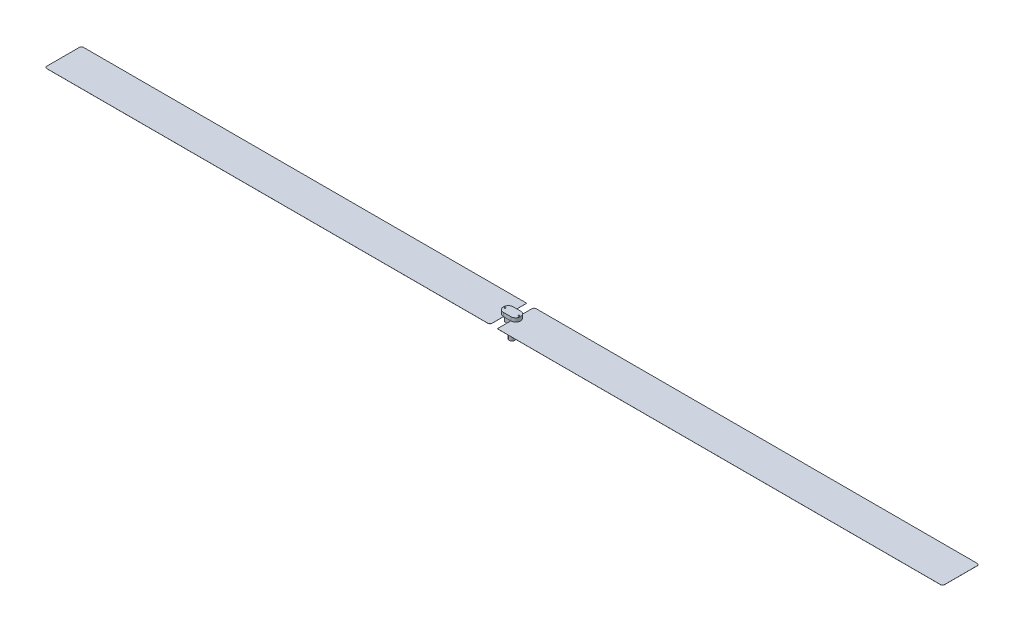
ISO-10303-21;
HEADER;
FILE_DESCRIPTION(('STEP AP214'),'2;1');
FILE_NAME('part.step','',(''),(''),'','','');
FILE_SCHEMA(('AUTOMOTIVE_DESIGN { 1 0 10303 214 1 1 1 1 }'));
ENDSEC;
DATA;
#1=APPLICATION_CONTEXT('core data for automotive mechanical design processes');
#2=APPLICATION_PROTOCOL_DEFINITION('international standard','automotive_design',2000,#1);
#3=PRODUCT_CONTEXT('',#1,'mechanical');
#4=PRODUCT('Part','Part','',(#3));
#5=PRODUCT_RELATED_PRODUCT_CATEGORY('part','',(#4));
#6=PRODUCT_DEFINITION_FORMATION('','',#4);
#7=PRODUCT_DEFINITION_CONTEXT('part definition',#1,'design');
#8=PRODUCT_DEFINITION('design','',#6,#7);
#9=PRODUCT_DEFINITION_SHAPE('','',#8);
#10=(LENGTH_UNIT() NAMED_UNIT(*) SI_UNIT(.MILLI.,.METRE.));
#11=(NAMED_UNIT(*) PLANE_ANGLE_UNIT() SI_UNIT($,.RADIAN.));
#12=(NAMED_UNIT(*) SI_UNIT($,.STERADIAN.) SOLID_ANGLE_UNIT());
#13=UNCERTAINTY_MEASURE_WITH_UNIT(LENGTH_MEASURE(1.E-05),#10,'distance_accuracy_value','');
#14=(GEOMETRIC_REPRESENTATION_CONTEXT(3) GLOBAL_UNCERTAINTY_ASSIGNED_CONTEXT((#13)) GLOBAL_UNIT_ASSIGNED_CONTEXT((#10,
#11,#12)) REPRESENTATION_CONTEXT('',''));
#15=CARTESIAN_POINT('',(0.,0.,0.));
#16=DIRECTION('',(0.,0.,1.));
#17=DIRECTION('',(1.,0.,0.));
#18=AXIS2_PLACEMENT_3D('',#15,#16,#17);
#19=CARTESIAN_POINT('',(-0.5,2.7,0.));
#20=DIRECTION('',(0.,1.,0.));
#21=DIRECTION('',(0.,0.,1.));
#22=AXIS2_PLACEMENT_3D('',#19,#20,#21);
#23=PLANE('',#22);
#24=DIRECTION('',(0.,0.,1.));
#25=VECTOR('',#24,1.);
#26=CARTESIAN_POINT('',(-0.5,2.7,-2.2));
#27=LINE('',#26,#25);
#28=CARTESIAN_POINT('',(-0.5,2.7,-0.662390111813238));
#29=VERTEX_POINT('',#28);
#30=CARTESIAN_POINT('',(-0.5,2.7,-0.5));
#31=VERTEX_POINT('',#30);
#32=EDGE_CURVE('E775',#29,#31,#27,.T.);
#33=ORIENTED_EDGE('',*,*,#32,.F.);
#34=DIRECTION('',(-1.,0.,0.));
#35=VECTOR('',#34,1.);
#36=CARTESIAN_POINT('',(-0.5,2.7,-0.662390111813238));
#37=LINE('',#36,#35);
#38=CARTESIAN_POINT('',(0.5,2.7,-0.662390111813238));
#39=VERTEX_POINT('',#38);
#40=EDGE_CURVE('E304',#39,#29,#37,.T.);
#41=ORIENTED_EDGE('',*,*,#40,.F.);
#42=DIRECTION('',(0.,0.,-1.));
#43=VECTOR('',#42,1.);
#44=CARTESIAN_POINT('',(0.5,2.7,-2.2));
#45=LINE('',#44,#43);
#46=CARTESIAN_POINT('',(0.5,2.7,-0.5));
#47=VERTEX_POINT('',#46);
#48=EDGE_CURVE('E801',#47,#39,#45,.T.);
#49=ORIENTED_EDGE('',*,*,#48,.F.);
#50=DIRECTION('',(-1.,0.,0.));
#51=VECTOR('',#50,1.);
#52=CARTESIAN_POINT('',(-0.5,2.7,-0.5));
#53=LINE('',#52,#51);
#54=EDGE_CURVE('E333',#47,#31,#53,.T.);
#55=ORIENTED_EDGE('',*,*,#54,.T.);
#56=EDGE_LOOP('',(#33,#41,#49,#55));
#57=FACE_BOUND('',#56,.T.);
#58=ADVANCED_FACE('F36',(#57),#23,.F.);
#59=CARTESIAN_POINT('',(-0.5,2.7,0.5));
#60=VERTEX_POINT('',#59);
#61=CARTESIAN_POINT('',(-0.5,2.7,0.662390111813238));
#62=VERTEX_POINT('',#61);
#63=EDGE_CURVE('E785',#60,#62,#27,.T.);
#64=ORIENTED_EDGE('',*,*,#63,.F.);
#65=DIRECTION('',(1.,0.,0.));
#66=VECTOR('',#65,1.);
#67=CARTESIAN_POINT('',(-0.5,2.7,0.5));
#68=LINE('',#67,#66);
#69=CARTESIAN_POINT('',(0.5,2.7,0.499999999999999));
#70=VERTEX_POINT('',#69);
#71=EDGE_CURVE('E336',#60,#70,#68,.T.);
#72=ORIENTED_EDGE('',*,*,#71,.T.);
#73=CARTESIAN_POINT('',(0.5,2.7,0.662390111813238));
#74=VERTEX_POINT('',#73);
#75=EDGE_CURVE('E258',#74,#70,#45,.T.);
#76=ORIENTED_EDGE('',*,*,#75,.F.);
#77=DIRECTION('',(1.,0.,0.));
#78=VECTOR('',#77,1.);
#79=CARTESIAN_POINT('',(-0.5,2.7,0.662390111813238));
#80=LINE('',#79,#78);
#81=EDGE_CURVE('E313',#62,#74,#80,.T.);
#82=ORIENTED_EDGE('',*,*,#81,.F.);
#83=EDGE_LOOP('',(#64,#72,#76,#82));
#84=FACE_BOUND('',#83,.T.);
#85=ADVANCED_FACE('F378',(#84),#23,.F.);
#86=CARTESIAN_POINT('',(-0.5,2.7,0.5));
#87=DIRECTION('',(1.,0.,0.));
#88=DIRECTION('',(0.,0.,-1.));
#89=AXIS2_PLACEMENT_3D('',#86,#87,#88);
#90=PLANE('',#89);
#91=DIRECTION('',(0.,0.,1.));
#92=VECTOR('',#91,1.);
#93=CARTESIAN_POINT('',(-0.5,2.69,-2.5));
#94=LINE('',#93,#92);
#95=CARTESIAN_POINT('',(-0.5,2.69,-0.5));
#96=VERTEX_POINT('',#95);
#97=CARTESIAN_POINT('',(-0.5,2.69,0.5));
#98=VERTEX_POINT('',#97);
#99=EDGE_CURVE('E821',#96,#98,#94,.T.);
#100=ORIENTED_EDGE('',*,*,#99,.F.);
#101=DIRECTION('',(0.,-1.,0.));
#102=VECTOR('',#101,1.);
#103=CARTESIAN_POINT('',(-0.5,2.7,-0.5));
#104=LINE('',#103,#102);
#105=CARTESIAN_POINT('',(-0.5,2.,-0.5));
#106=VERTEX_POINT('',#105);
#107=EDGE_CURVE('E351',#96,#106,#104,.T.);
#108=ORIENTED_EDGE('',*,*,#107,.T.);
#109=DIRECTION('',(0.,0.,1.));
#110=VECTOR('',#109,1.);
#111=CARTESIAN_POINT('',(-0.5,2.,0.5));
#112=LINE('',#111,#110);
#113=CARTESIAN_POINT('',(-0.5,2.,0.5));
#114=VERTEX_POINT('',#113);
#115=EDGE_CURVE('E344',#106,#114,#112,.T.);
#116=ORIENTED_EDGE('',*,*,#115,.T.);
#117=DIRECTION('',(0.,-1.,0.));
#118=VECTOR('',#117,1.);
#119=CARTESIAN_POINT('',(-0.5,2.7,0.5));
#120=LINE('',#119,#118);
#121=EDGE_CURVE('E58',#98,#114,#120,.T.);
#122=ORIENTED_EDGE('',*,*,#121,.F.);
#123=EDGE_LOOP('',(#100,#108,#116,#122));
#124=FACE_BOUND('',#123,.T.);
#125=ADVANCED_FACE('F371',(#124),#90,.F.);
#126=CARTESIAN_POINT('',(0.,0.,0.));
#127=DIRECTION('',(0.,1.,0.));
#128=DIRECTION('',(0.,0.,1.));
#129=AXIS2_PLACEMENT_3D('',#126,#127,#128);
#130=PLANE('',#129);
#131=CARTESIAN_POINT('',(0.,0.,0.));
#132=DIRECTION('',(0.,1.,0.));
#133=DIRECTION('',(0.,0.,1.));
#134=AXIS2_PLACEMENT_3D('',#131,#132,#133);
#135=CIRCLE('',#134,0.377024050356376);
#136=CARTESIAN_POINT('',(0.,0.,0.377024050356376));
#137=VERTEX_POINT('',#136);
#138=EDGE_CURVE('E40',#137,#137,#135,.T.);
#139=ORIENTED_EDGE('',*,*,#138,.F.);
#140=EDGE_LOOP('',(#139));
#141=FACE_BOUND('',#140,.T.);
#142=CARTESIAN_POINT('',(0.,0.,0.));
#143=DIRECTION('',(0.,1.,0.));
#144=DIRECTION('',(0.,0.,1.));
#145=AXIS2_PLACEMENT_3D('',#142,#143,#144);
#146=CIRCLE('',#145,0.3);
#147=CARTESIAN_POINT('',(0.,0.,0.3));
#148=VERTEX_POINT('',#147);
#149=EDGE_CURVE('E361',#148,#148,#146,.T.);
#150=ORIENTED_EDGE('',*,*,#149,.T.);
#151=EDGE_LOOP('',(#150));
#152=FACE_BOUND('',#151,.T.);
#153=ADVANCED_FACE('F369',(#141,#152),#130,.F.);
#154=CARTESIAN_POINT('',(0.,2.,0.));
#155=DIRECTION('',(0.,-1.,0.));
#156=DIRECTION('',(0.,0.,-1.));
#157=AXIS2_PLACEMENT_3D('',#154,#155,#156);
#158=CYLINDRICAL_SURFACE('',#157,0.377024050356376);
#159=CARTESIAN_POINT('',(0.,2.,0.));
#160=DIRECTION('',(0.,1.,0.));
#161=DIRECTION('',(0.,0.,1.));
#162=AXIS2_PLACEMENT_3D('',#159,#160,#161);
#163=CIRCLE('',#162,0.377024050356376);
#164=CARTESIAN_POINT('',(0.,2.,0.377024050356376));
#165=VERTEX_POINT('',#164);
#166=EDGE_CURVE('E11',#165,#165,#163,.T.);
#167=ORIENTED_EDGE('',*,*,#166,.F.);
#168=EDGE_LOOP('',(#167));
#169=FACE_BOUND('',#168,.T.);
#170=ORIENTED_EDGE('',*,*,#138,.T.);
#171=EDGE_LOOP('',(#170));
#172=FACE_BOUND('',#171,.T.);
#173=ADVANCED_FACE('F38',(#169,#172),#158,.T.);
#174=CARTESIAN_POINT('',(0.,2.,0.));
#175=DIRECTION('',(0.,-1.,0.));
#176=DIRECTION('',(0.,0.,-1.));
#177=AXIS2_PLACEMENT_3D('',#174,#175,#176);
#178=CYLINDRICAL_SURFACE('',#177,0.3);
#179=CARTESIAN_POINT('',(0.,2.,0.));
#180=DIRECTION('',(0.,1.,0.));
#181=DIRECTION('',(0.,0.,1.));
#182=AXIS2_PLACEMENT_3D('',#179,#180,#181);
#183=CIRCLE('',#182,0.3);
#184=CARTESIAN_POINT('',(0.,2.,0.3));
#185=VERTEX_POINT('',#184);
#186=EDGE_CURVE('E358',#185,#185,#183,.T.);
#187=ORIENTED_EDGE('',*,*,#186,.T.);
#188=EDGE_LOOP('',(#187));
#189=FACE_BOUND('',#188,.T.);
#190=ORIENTED_EDGE('',*,*,#149,.F.);
#191=EDGE_LOOP('',(#190));
#192=FACE_BOUND('',#191,.T.);
#193=ADVANCED_FACE('F376',(#189,#192),#178,.F.);
#194=CARTESIAN_POINT('',(0.,2.,0.));
#195=DIRECTION('',(0.,-1.,0.));
#196=DIRECTION('',(0.,0.,-1.));
#197=AXIS2_PLACEMENT_3D('',#194,#195,#196);
#198=PLANE('',#197);
#199=ORIENTED_EDGE('',*,*,#186,.F.);
#200=EDGE_LOOP('',(#199));
#201=FACE_BOUND('',#200,.T.);
#202=ADVANCED_FACE('F415',(#201),#198,.T.);
#203=CARTESIAN_POINT('',(0.5,2.7,0.5));
#204=DIRECTION('',(-1.,0.,0.));
#205=DIRECTION('',(0.,0.,1.));
#206=AXIS2_PLACEMENT_3D('',#203,#204,#205);
#207=PLANE('',#206);
#208=DIRECTION('',(0.,-1.,0.));
#209=VECTOR('',#208,1.);
#210=CARTESIAN_POINT('',(0.5,2.7,-0.5));
#211=LINE('',#210,#209);
#212=CARTESIAN_POINT('',(0.5,2.69,-0.5));
#213=VERTEX_POINT('',#212);
#214=CARTESIAN_POINT('',(0.5,2.,-0.5));
#215=VERTEX_POINT('',#214);
#216=EDGE_CURVE('E354',#213,#215,#211,.T.);
#217=ORIENTED_EDGE('',*,*,#216,.F.);
#218=DIRECTION('',(0.,0.,-1.));
#219=VECTOR('',#218,1.);
#220=CARTESIAN_POINT('',(0.5,2.69,-2.2));
#221=LINE('',#220,#219);
#222=CARTESIAN_POINT('',(0.5,2.69,0.499999999999999));
#223=VERTEX_POINT('',#222);
#224=EDGE_CURVE('E243',#223,#213,#221,.T.);
#225=ORIENTED_EDGE('',*,*,#224,.F.);
#226=DIRECTION('',(0.,-1.,0.));
#227=VECTOR('',#226,1.);
#228=CARTESIAN_POINT('',(0.5,2.7,0.5));
#229=LINE('',#228,#227);
#230=CARTESIAN_POINT('',(0.5,2.,0.5));
#231=VERTEX_POINT('',#230);
#232=EDGE_CURVE('E51',#223,#231,#229,.T.);
#233=ORIENTED_EDGE('',*,*,#232,.T.);
#234=DIRECTION('',(0.,0.,-1.));
#235=VECTOR('',#234,1.);
#236=CARTESIAN_POINT('',(0.5,2.,0.5));
#237=LINE('',#236,#235);
#238=EDGE_CURVE('E332',#231,#215,#237,.T.);
#239=ORIENTED_EDGE('',*,*,#238,.T.);
#240=EDGE_LOOP('',(#217,#225,#233,#239));
#241=FACE_BOUND('',#240,.T.);
#242=ADVANCED_FACE('F421',(#241),#207,.F.);
#243=CARTESIAN_POINT('',(-0.5,2.7,-0.5));
#244=DIRECTION('',(0.,0.,1.));
#245=DIRECTION('',(1.,0.,0.));
#246=AXIS2_PLACEMENT_3D('',#243,#244,#245);
#247=PLANE('',#246);
#248=DIRECTION('',(-1.,0.,0.));
#249=VECTOR('',#248,1.);
#250=CARTESIAN_POINT('',(-0.5,2.,-0.5));
#251=LINE('',#250,#249);
#252=EDGE_CURVE('E341',#215,#106,#251,.T.);
#253=ORIENTED_EDGE('',*,*,#252,.T.);
#254=ORIENTED_EDGE('',*,*,#107,.F.);
#255=EDGE_CURVE('E352',#31,#96,#104,.T.);
#256=ORIENTED_EDGE('',*,*,#255,.F.);
#257=ORIENTED_EDGE('',*,*,#54,.F.);
#258=EDGE_CURVE('E355',#47,#213,#211,.T.);
#259=ORIENTED_EDGE('',*,*,#258,.T.);
#260=ORIENTED_EDGE('',*,*,#216,.T.);
#261=EDGE_LOOP('',(#253,#254,#256,#257,#259,#260));
#262=FACE_BOUND('',#261,.T.);
#263=ADVANCED_FACE('F417',(#262),#247,.F.);
#264=CARTESIAN_POINT('',(-0.5,2.7,0.5));
#265=DIRECTION('',(0.,0.,-1.));
#266=DIRECTION('',(-1.,0.,0.));
#267=AXIS2_PLACEMENT_3D('',#264,#265,#266);
#268=PLANE('',#267);
#269=DIRECTION('',(1.,0.,0.));
#270=VECTOR('',#269,1.);
#271=CARTESIAN_POINT('',(-0.5,2.,0.5));
#272=LINE('',#271,#270);
#273=EDGE_CURVE('E337',#114,#231,#272,.T.);
#274=ORIENTED_EDGE('',*,*,#273,.T.);
#275=ORIENTED_EDGE('',*,*,#232,.F.);
#276=EDGE_CURVE('E347',#70,#223,#229,.T.);
#277=ORIENTED_EDGE('',*,*,#276,.F.);
#278=ORIENTED_EDGE('',*,*,#71,.F.);
#279=EDGE_CURVE('E349',#60,#98,#120,.T.);
#280=ORIENTED_EDGE('',*,*,#279,.T.);
#281=ORIENTED_EDGE('',*,*,#121,.T.);
#282=EDGE_LOOP('',(#274,#275,#277,#278,#280,#281));
#283=FACE_BOUND('',#282,.T.);
#284=ADVANCED_FACE('F413',(#283),#268,.F.);
#285=ORIENTED_EDGE('',*,*,#166,.T.);
#286=EDGE_LOOP('',(#285));
#287=FACE_BOUND('',#286,.T.);
#288=ORIENTED_EDGE('',*,*,#238,.F.);
#289=ORIENTED_EDGE('',*,*,#273,.F.);
#290=ORIENTED_EDGE('',*,*,#115,.F.);
#291=ORIENTED_EDGE('',*,*,#252,.F.);
#292=EDGE_LOOP('',(#288,#289,#290,#291));
#293=FACE_BOUND('',#292,.T.);
#294=ADVANCED_FACE('F409',(#287,#293),#198,.T.);
#295=CARTESIAN_POINT('',(-0.5,3.2,0.));
#296=DIRECTION('',(0.,-1.,0.));
#297=DIRECTION('',(0.,0.,-1.));
#298=AXIS2_PLACEMENT_3D('',#295,#296,#297);
#299=CYLINDRICAL_SURFACE('',#298,0.662390111813238);
#300=CARTESIAN_POINT('',(-0.5,2.7,0.));
#301=DIRECTION('',(0.,1.,0.));
#302=DIRECTION('',(0.,0.,1.));
#303=AXIS2_PLACEMENT_3D('',#300,#301,#302);
#304=CIRCLE('',#303,0.662390111813238);
#305=EDGE_CURVE('E291',#29,#62,#304,.T.);
#306=ORIENTED_EDGE('',*,*,#305,.T.);
#307=DIRECTION('',(0.,-1.,0.));
#308=VECTOR('',#307,1.);
#309=CARTESIAN_POINT('',(-0.5,3.2,0.662390111813238));
#310=LINE('',#309,#308);
#311=CARTESIAN_POINT('',(-0.5,3.2,0.662390111813238));
#312=VERTEX_POINT('',#311);
#313=EDGE_CURVE('E329',#312,#62,#310,.T.);
#314=ORIENTED_EDGE('',*,*,#313,.F.);
#315=CARTESIAN_POINT('',(-0.5,3.2,0.));
#316=DIRECTION('',(0.,1.,0.));
#317=DIRECTION('',(0.,0.,1.));
#318=AXIS2_PLACEMENT_3D('',#315,#316,#317);
#319=CIRCLE('',#318,0.662390111813238);
#320=CARTESIAN_POINT('',(-0.5,3.2,-0.662390111813238));
#321=VERTEX_POINT('',#320);
#322=EDGE_CURVE('E300',#321,#312,#319,.T.);
#323=ORIENTED_EDGE('',*,*,#322,.F.);
#324=DIRECTION('',(0.,-1.,0.));
#325=VECTOR('',#324,1.);
#326=CARTESIAN_POINT('',(-0.5,3.2,-0.662390111813238));
#327=LINE('',#326,#325);
#328=EDGE_CURVE('E310',#321,#29,#327,.T.);
#329=ORIENTED_EDGE('',*,*,#328,.T.);
#330=EDGE_LOOP('',(#306,#314,#323,#329));
#331=FACE_BOUND('',#330,.T.);
#332=ADVANCED_FACE('F405',(#331),#299,.T.);
#333=CARTESIAN_POINT('',(-0.5,3.2,0.662390111813238));
#334=DIRECTION('',(0.,0.,-1.));
#335=DIRECTION('',(-1.,0.,0.));
#336=AXIS2_PLACEMENT_3D('',#333,#334,#335);
#337=PLANE('',#336);
#338=ORIENTED_EDGE('',*,*,#81,.T.);
#339=DIRECTION('',(0.,-1.,0.));
#340=VECTOR('',#339,1.);
#341=CARTESIAN_POINT('',(0.5,3.2,0.662390111813238));
#342=LINE('',#341,#340);
#343=CARTESIAN_POINT('',(0.5,3.2,0.662390111813238));
#344=VERTEX_POINT('',#343);
#345=EDGE_CURVE('E326',#344,#74,#342,.T.);
#346=ORIENTED_EDGE('',*,*,#345,.F.);
#347=DIRECTION('',(1.,0.,0.));
#348=VECTOR('',#347,1.);
#349=CARTESIAN_POINT('',(-0.5,3.2,0.662390111813238));
#350=LINE('',#349,#348);
#351=EDGE_CURVE('E303',#312,#344,#350,.T.);
#352=ORIENTED_EDGE('',*,*,#351,.F.);
#353=ORIENTED_EDGE('',*,*,#313,.T.);
#354=EDGE_LOOP('',(#338,#346,#352,#353));
#355=FACE_BOUND('',#354,.T.);
#356=ADVANCED_FACE('F401',(#355),#337,.F.);
#357=CARTESIAN_POINT('',(0.5,3.2,0.));
#358=DIRECTION('',(0.,-1.,0.));
#359=DIRECTION('',(0.,0.,-1.));
#360=AXIS2_PLACEMENT_3D('',#357,#358,#359);
#361=CYLINDRICAL_SURFACE('',#360,0.662390111813238);
#362=CARTESIAN_POINT('',(0.5,2.7,0.));
#363=DIRECTION('',(0.,1.,0.));
#364=DIRECTION('',(0.,0.,1.));
#365=AXIS2_PLACEMENT_3D('',#362,#363,#364);
#366=CIRCLE('',#365,0.662390111813238);
#367=EDGE_CURVE('E316',#74,#39,#366,.T.);
#368=ORIENTED_EDGE('',*,*,#367,.T.);
#369=DIRECTION('',(0.,-1.,0.));
#370=VECTOR('',#369,1.);
#371=CARTESIAN_POINT('',(0.5,3.2,-0.662390111813238));
#372=LINE('',#371,#370);
#373=CARTESIAN_POINT('',(0.5,3.2,-0.662390111813238));
#374=VERTEX_POINT('',#373);
#375=EDGE_CURVE('E323',#374,#39,#372,.T.);
#376=ORIENTED_EDGE('',*,*,#375,.F.);
#377=CARTESIAN_POINT('',(0.5,3.2,0.));
#378=DIRECTION('',(0.,1.,0.));
#379=DIRECTION('',(0.,0.,1.));
#380=AXIS2_PLACEMENT_3D('',#377,#378,#379);
#381=CIRCLE('',#380,0.662390111813238);
#382=EDGE_CURVE('E306',#344,#374,#381,.T.);
#383=ORIENTED_EDGE('',*,*,#382,.F.);
#384=ORIENTED_EDGE('',*,*,#345,.T.);
#385=EDGE_LOOP('',(#368,#376,#383,#384));
#386=FACE_BOUND('',#385,.T.);
#387=ADVANCED_FACE('F397',(#386),#361,.T.);
#388=CARTESIAN_POINT('',(-0.5,3.2,-0.662390111813238));
#389=DIRECTION('',(0.,0.,1.));
#390=DIRECTION('',(1.,0.,0.));
#391=AXIS2_PLACEMENT_3D('',#388,#389,#390);
#392=PLANE('',#391);
#393=ORIENTED_EDGE('',*,*,#40,.T.);
#394=ORIENTED_EDGE('',*,*,#328,.F.);
#395=DIRECTION('',(-1.,0.,0.));
#396=VECTOR('',#395,1.);
#397=CARTESIAN_POINT('',(-0.5,3.2,-0.662390111813238));
#398=LINE('',#397,#396);
#399=EDGE_CURVE('E308',#374,#321,#398,.T.);
#400=ORIENTED_EDGE('',*,*,#399,.F.);
#401=ORIENTED_EDGE('',*,*,#375,.T.);
#402=EDGE_LOOP('',(#393,#394,#400,#401));
#403=FACE_BOUND('',#402,.T.);
#404=ADVANCED_FACE('F394',(#403),#392,.F.);
#405=CARTESIAN_POINT('',(-0.5,3.2,0.));
#406=DIRECTION('',(0.,1.,0.));
#407=DIRECTION('',(0.,0.,1.));
#408=AXIS2_PLACEMENT_3D('',#405,#406,#407);
#409=PLANE('',#408);
#410=CARTESIAN_POINT('',(-0.941559444713464,3.2,0.));
#411=DIRECTION('',(0.,1.,0.));
#412=DIRECTION('',(0.,0.,1.));
#413=AXIS2_PLACEMENT_3D('',#410,#411,#412);
#414=CIRCLE('',#413,0.1);
#415=CARTESIAN_POINT('',(-0.941559444713464,3.2,0.0999999999999889));
#416=VERTEX_POINT('',#415);
#417=EDGE_CURVE('E292',#416,#416,#414,.T.);
#418=ORIENTED_EDGE('',*,*,#417,.F.);
#419=EDGE_LOOP('',(#418));
#420=FACE_BOUND('',#419,.T.);
#421=CARTESIAN_POINT('',(0.941559444713464,3.2,0.));
#422=DIRECTION('',(0.,1.,0.));
#423=DIRECTION('',(0.,0.,-1.));
#424=AXIS2_PLACEMENT_3D('',#421,#422,#423);
#425=CIRCLE('',#424,0.1);
#426=CARTESIAN_POINT('',(0.941559444713464,3.2,-0.100000000000011));
#427=VERTEX_POINT('',#426);
#428=EDGE_CURVE('E287',#427,#427,#425,.T.);
#429=ORIENTED_EDGE('',*,*,#428,.F.);
#430=EDGE_LOOP('',(#429));
#431=FACE_BOUND('',#430,.T.);
#432=ORIENTED_EDGE('',*,*,#322,.T.);
#433=ORIENTED_EDGE('',*,*,#351,.T.);
#434=ORIENTED_EDGE('',*,*,#382,.T.);
#435=ORIENTED_EDGE('',*,*,#399,.T.);
#436=EDGE_LOOP('',(#432,#433,#434,#435));
#437=FACE_BOUND('',#436,.T.);
#438=ADVANCED_FACE('F392',(#420,#431,#437),#409,.T.);
#439=CARTESIAN_POINT('',(0.941559444713464,2.8,0.));
#440=DIRECTION('',(0.,1.,0.));
#441=DIRECTION('',(0.,0.,1.));
#442=AXIS2_PLACEMENT_3D('',#439,#440,#441);
#443=CYLINDRICAL_SURFACE('',#442,0.1);
#444=CARTESIAN_POINT('',(0.941559444713464,2.8,0.));
#445=DIRECTION('',(0.,1.,0.));
#446=DIRECTION('',(0.,0.,-1.));
#447=AXIS2_PLACEMENT_3D('',#444,#445,#446);
#448=CIRCLE('',#447,0.1);
#449=CARTESIAN_POINT('',(0.941559444713464,2.8,-0.100000000000011));
#450=VERTEX_POINT('',#449);
#451=EDGE_CURVE('E295',#450,#450,#448,.T.);
#452=ORIENTED_EDGE('',*,*,#451,.F.);
#453=EDGE_LOOP('',(#452));
#454=FACE_BOUND('',#453,.T.);
#455=ORIENTED_EDGE('',*,*,#428,.T.);
#456=EDGE_LOOP('',(#455));
#457=FACE_BOUND('',#456,.T.);
#458=ADVANCED_FACE('F474',(#454,#457),#443,.F.);
#459=CARTESIAN_POINT('',(0.941559444713464,2.8,0.));
#460=DIRECTION('',(0.,-1.,0.));
#461=DIRECTION('',(0.,0.,-1.));
#462=AXIS2_PLACEMENT_3D('',#459,#460,#461);
#463=PLANE('',#462);
#464=ORIENTED_EDGE('',*,*,#451,.T.);
#465=EDGE_LOOP('',(#464));
#466=FACE_BOUND('',#465,.T.);
#467=ADVANCED_FACE('F481',(#466),#463,.F.);
#468=CARTESIAN_POINT('',(-0.941559444713464,2.8,0.));
#469=DIRECTION('',(0.,1.,0.));
#470=DIRECTION('',(0.,0.,1.));
#471=AXIS2_PLACEMENT_3D('',#468,#469,#470);
#472=CYLINDRICAL_SURFACE('',#471,0.1);
#473=CARTESIAN_POINT('',(-0.941559444713464,2.8,0.));
#474=DIRECTION('',(0.,1.,0.));
#475=DIRECTION('',(0.,0.,1.));
#476=AXIS2_PLACEMENT_3D('',#473,#474,#475);
#477=CIRCLE('',#476,0.1);
#478=CARTESIAN_POINT('',(-0.941559444713464,2.8,0.0999999999999889));
#479=VERTEX_POINT('',#478);
#480=EDGE_CURVE('E288',#479,#479,#477,.T.);
#481=ORIENTED_EDGE('',*,*,#480,.F.);
#482=EDGE_LOOP('',(#481));
#483=FACE_BOUND('',#482,.T.);
#484=ORIENTED_EDGE('',*,*,#417,.T.);
#485=EDGE_LOOP('',(#484));
#486=FACE_BOUND('',#485,.T.);
#487=ADVANCED_FACE('F488',(#483,#486),#472,.F.);
#488=CARTESIAN_POINT('',(-0.941559444713464,2.8,0.));
#489=DIRECTION('',(0.,1.,0.));
#490=DIRECTION('',(0.,0.,1.));
#491=AXIS2_PLACEMENT_3D('',#488,#489,#490);
#492=PLANE('',#491);
#493=ORIENTED_EDGE('',*,*,#480,.T.);
#494=EDGE_LOOP('',(#493));
#495=FACE_BOUND('',#494,.T.);
#496=ADVANCED_FACE('F496',(#495),#492,.T.);
#497=CARTESIAN_POINT('',(0.5,2.69,-2.2));
#498=DIRECTION('',(1.,0.,0.));
#499=DIRECTION('',(0.,0.,-1.));
#500=AXIS2_PLACEMENT_3D('',#497,#498,#499);
#501=PLANE('',#500);
#502=CARTESIAN_POINT('',(0.5,2.69,-2.2));
#503=VERTEX_POINT('',#502);
#504=EDGE_CURVE('E237',#213,#503,#221,.T.);
#505=ORIENTED_EDGE('',*,*,#504,.F.);
#506=ORIENTED_EDGE('',*,*,#258,.F.);
#507=ORIENTED_EDGE('',*,*,#48,.T.);
#508=CARTESIAN_POINT('',(0.5,2.7,-2.2));
#509=VERTEX_POINT('',#508);
#510=EDGE_CURVE('E228',#39,#509,#45,.T.);
#511=ORIENTED_EDGE('',*,*,#510,.T.);
#512=DIRECTION('',(0.,1.,0.));
#513=VECTOR('',#512,1.);
#514=CARTESIAN_POINT('',(0.5,2.69,-2.2));
#515=LINE('',#514,#513);
#516=EDGE_CURVE('E281',#503,#509,#515,.T.);
#517=ORIENTED_EDGE('',*,*,#516,.F.);
#518=EDGE_LOOP('',(#505,#506,#507,#511,#517));
#519=FACE_BOUND('',#518,.T.);
#520=ADVANCED_FACE('F504',(#519),#501,.F.);
#521=ORIENTED_EDGE('',*,*,#75,.T.);
#522=ORIENTED_EDGE('',*,*,#276,.T.);
#523=CARTESIAN_POINT('',(0.5,2.69,2.5));
#524=VERTEX_POINT('',#523);
#525=EDGE_CURVE('E239',#524,#223,#221,.T.);
#526=ORIENTED_EDGE('',*,*,#525,.F.);
#527=DIRECTION('',(0.,1.,0.));
#528=VECTOR('',#527,1.);
#529=CARTESIAN_POINT('',(0.5,2.69,2.5));
#530=LINE('',#529,#528);
#531=CARTESIAN_POINT('',(0.5,2.7,2.5));
#532=VERTEX_POINT('',#531);
#533=EDGE_CURVE('E284',#524,#532,#530,.T.);
#534=ORIENTED_EDGE('',*,*,#533,.T.);
#535=EDGE_CURVE('E254',#532,#74,#45,.T.);
#536=ORIENTED_EDGE('',*,*,#535,.T.);
#537=EDGE_LOOP('',(#521,#522,#526,#534,#536));
#538=FACE_BOUND('',#537,.T.);
#539=ADVANCED_FACE('F511',(#538),#501,.F.);
#540=CARTESIAN_POINT('',(0.5,2.69,2.5));
#541=DIRECTION('',(0.,0.,-1.));
#542=DIRECTION('',(-1.,0.,0.));
#543=AXIS2_PLACEMENT_3D('',#540,#541,#542);
#544=PLANE('',#543);
#545=DIRECTION('',(-1.,0.,0.));
#546=VECTOR('',#545,1.);
#547=CARTESIAN_POINT('',(0.5,2.7,2.5));
#548=LINE('',#547,#546);
#549=CARTESIAN_POINT('',(60.8,2.7,2.5));
#550=VERTEX_POINT('',#549);
#551=EDGE_CURVE('E225',#550,#532,#548,.T.);
#552=ORIENTED_EDGE('',*,*,#551,.T.);
#553=ORIENTED_EDGE('',*,*,#533,.F.);
#554=DIRECTION('',(-1.,0.,0.));
#555=VECTOR('',#554,1.);
#556=CARTESIAN_POINT('',(0.5,2.69,2.5));
#557=LINE('',#556,#555);
#558=CARTESIAN_POINT('',(60.8,2.69,2.5));
#559=VERTEX_POINT('',#558);
#560=EDGE_CURVE('E234',#559,#524,#557,.T.);
#561=ORIENTED_EDGE('',*,*,#560,.F.);
#562=DIRECTION('',(0.,1.,0.));
#563=VECTOR('',#562,1.);
#564=CARTESIAN_POINT('',(60.8,2.69,2.5));
#565=LINE('',#564,#563);
#566=EDGE_CURVE('E252',#559,#550,#565,.T.);
#567=ORIENTED_EDGE('',*,*,#566,.T.);
#568=EDGE_LOOP('',(#552,#553,#561,#567));
#569=FACE_BOUND('',#568,.T.);
#570=ADVANCED_FACE('F519',(#569),#544,.F.);
#571=CARTESIAN_POINT('',(0.8,2.69,-2.2));
#572=DIRECTION('',(0.,1.,0.));
#573=DIRECTION('',(0.,0.,1.));
#574=AXIS2_PLACEMENT_3D('',#571,#572,#573);
#575=CYLINDRICAL_SURFACE('',#574,0.3);
#576=CARTESIAN_POINT('',(0.8,2.7,-2.2));
#577=DIRECTION('',(0.,-1.,0.));
#578=DIRECTION('',(0.,0.,1.));
#579=AXIS2_PLACEMENT_3D('',#576,#577,#578);
#580=CIRCLE('',#579,0.3);
#581=CARTESIAN_POINT('',(0.8,2.7,-2.5));
#582=VERTEX_POINT('',#581);
#583=EDGE_CURVE('E257',#509,#582,#580,.T.);
#584=ORIENTED_EDGE('',*,*,#583,.T.);
#585=DIRECTION('',(0.,1.,0.));
#586=VECTOR('',#585,1.);
#587=CARTESIAN_POINT('',(0.8,2.69,-2.5));
#588=LINE('',#587,#586);
#589=CARTESIAN_POINT('',(0.8,2.69,-2.5));
#590=VERTEX_POINT('',#589);
#591=EDGE_CURVE('E278',#590,#582,#588,.T.);
#592=ORIENTED_EDGE('',*,*,#591,.F.);
#593=CARTESIAN_POINT('',(0.8,2.69,-2.2));
#594=DIRECTION('',(0.,-1.,0.));
#595=DIRECTION('',(0.,0.,1.));
#596=AXIS2_PLACEMENT_3D('',#593,#594,#595);
#597=CIRCLE('',#596,0.3);
#598=EDGE_CURVE('E242',#503,#590,#597,.T.);
#599=ORIENTED_EDGE('',*,*,#598,.F.);
#600=ORIENTED_EDGE('',*,*,#516,.T.);
#601=EDGE_LOOP('',(#584,#592,#599,#600));
#602=FACE_BOUND('',#601,.T.);
#603=ADVANCED_FACE('F526',(#602),#575,.T.);
#604=CARTESIAN_POINT('',(0.8,2.69,-2.5));
#605=DIRECTION('',(0.,0.,1.));
#606=DIRECTION('',(1.,0.,0.));
#607=AXIS2_PLACEMENT_3D('',#604,#605,#606);
#608=PLANE('',#607);
#609=DIRECTION('',(1.,0.,0.));
#610=VECTOR('',#609,1.);
#611=CARTESIAN_POINT('',(0.8,2.7,-2.5));
#612=LINE('',#611,#610);
#613=CARTESIAN_POINT('',(60.8,2.7,-2.5));
#614=VERTEX_POINT('',#613);
#615=EDGE_CURVE('E260',#582,#614,#612,.T.);
#616=ORIENTED_EDGE('',*,*,#615,.T.);
#617=DIRECTION('',(0.,1.,0.));
#618=VECTOR('',#617,1.);
#619=CARTESIAN_POINT('',(60.8,2.69,-2.5));
#620=LINE('',#619,#618);
#621=CARTESIAN_POINT('',(60.8,2.69,-2.5));
#622=VERTEX_POINT('',#621);
#623=EDGE_CURVE('E275',#622,#614,#620,.T.);
#624=ORIENTED_EDGE('',*,*,#623,.F.);
#625=DIRECTION('',(1.,0.,0.));
#626=VECTOR('',#625,1.);
#627=CARTESIAN_POINT('',(0.8,2.69,-2.5));
#628=LINE('',#627,#626);
#629=EDGE_CURVE('E245',#590,#622,#628,.T.);
#630=ORIENTED_EDGE('',*,*,#629,.F.);
#631=ORIENTED_EDGE('',*,*,#591,.T.);
#632=EDGE_LOOP('',(#616,#624,#630,#631));
#633=FACE_BOUND('',#632,.T.);
#634=ADVANCED_FACE('F534',(#633),#608,.F.);
#635=CARTESIAN_POINT('',(60.8,2.69,-2.2));
#636=DIRECTION('',(0.,1.,0.));
#637=DIRECTION('',(0.,0.,1.));
#638=AXIS2_PLACEMENT_3D('',#635,#636,#637);
#639=CYLINDRICAL_SURFACE('',#638,0.300000000000001);
#640=CARTESIAN_POINT('',(60.8,2.7,-2.2));
#641=DIRECTION('',(0.,-1.,0.));
#642=DIRECTION('',(0.,0.,-1.));
#643=AXIS2_PLACEMENT_3D('',#640,#641,#642);
#644=CIRCLE('',#643,0.300000000000001);
#645=CARTESIAN_POINT('',(61.1,2.7,-2.2));
#646=VERTEX_POINT('',#645);
#647=EDGE_CURVE('E262',#614,#646,#644,.T.);
#648=ORIENTED_EDGE('',*,*,#647,.T.);
#649=DIRECTION('',(0.,1.,0.));
#650=VECTOR('',#649,1.);
#651=CARTESIAN_POINT('',(61.1,2.69,-2.2));
#652=LINE('',#651,#650);
#653=CARTESIAN_POINT('',(61.1,2.69,-2.2));
#654=VERTEX_POINT('',#653);
#655=EDGE_CURVE('E272',#654,#646,#652,.T.);
#656=ORIENTED_EDGE('',*,*,#655,.F.);
#657=CARTESIAN_POINT('',(60.8,2.69,-2.2));
#658=DIRECTION('',(0.,-1.,0.));
#659=DIRECTION('',(0.,0.,-1.));
#660=AXIS2_PLACEMENT_3D('',#657,#658,#659);
#661=CIRCLE('',#660,0.300000000000001);
#662=EDGE_CURVE('E247',#622,#654,#661,.T.);
#663=ORIENTED_EDGE('',*,*,#662,.F.);
#664=ORIENTED_EDGE('',*,*,#623,.T.);
#665=EDGE_LOOP('',(#648,#656,#663,#664));
#666=FACE_BOUND('',#665,.T.);
#667=ADVANCED_FACE('F542',(#666),#639,.T.);
#668=CARTESIAN_POINT('',(61.1,2.69,-2.2));
#669=DIRECTION('',(-1.,0.,0.));
#670=DIRECTION('',(0.,0.,1.));
#671=AXIS2_PLACEMENT_3D('',#668,#669,#670);
#672=PLANE('',#671);
#673=DIRECTION('',(0.,0.,1.));
#674=VECTOR('',#673,1.);
#675=CARTESIAN_POINT('',(61.1,2.7,-2.2));
#676=LINE('',#675,#674);
#677=CARTESIAN_POINT('',(61.1,2.7,2.2));
#678=VERTEX_POINT('',#677);
#679=EDGE_CURVE('E264',#646,#678,#676,.T.);
#680=ORIENTED_EDGE('',*,*,#679,.T.);
#681=DIRECTION('',(0.,1.,0.));
#682=VECTOR('',#681,1.);
#683=CARTESIAN_POINT('',(61.1,2.69,2.2));
#684=LINE('',#683,#682);
#685=CARTESIAN_POINT('',(61.1,2.69,2.2));
#686=VERTEX_POINT('',#685);
#687=EDGE_CURVE('E269',#686,#678,#684,.T.);
#688=ORIENTED_EDGE('',*,*,#687,.F.);
#689=DIRECTION('',(0.,0.,1.));
#690=VECTOR('',#689,1.);
#691=CARTESIAN_POINT('',(61.1,2.69,-2.2));
#692=LINE('',#691,#690);
#693=EDGE_CURVE('E249',#654,#686,#692,.T.);
#694=ORIENTED_EDGE('',*,*,#693,.F.);
#695=ORIENTED_EDGE('',*,*,#655,.T.);
#696=EDGE_LOOP('',(#680,#688,#694,#695));
#697=FACE_BOUND('',#696,.T.);
#698=ADVANCED_FACE('F550',(#697),#672,.F.);
#699=CARTESIAN_POINT('',(60.8,2.69,2.2));
#700=DIRECTION('',(0.,1.,0.));
#701=DIRECTION('',(0.,0.,1.));
#702=AXIS2_PLACEMENT_3D('',#699,#700,#701);
#703=CYLINDRICAL_SURFACE('',#702,0.300000000000001);
#704=CARTESIAN_POINT('',(60.8,2.7,2.2));
#705=DIRECTION('',(0.,-1.,0.));
#706=DIRECTION('',(0.,0.,-1.));
#707=AXIS2_PLACEMENT_3D('',#704,#705,#706);
#708=CIRCLE('',#707,0.300000000000001);
#709=EDGE_CURVE('E238',#678,#550,#708,.T.);
#710=ORIENTED_EDGE('',*,*,#709,.T.);
#711=ORIENTED_EDGE('',*,*,#566,.F.);
#712=CARTESIAN_POINT('',(60.8,2.69,2.2));
#713=DIRECTION('',(0.,-1.,0.));
#714=DIRECTION('',(0.,0.,-1.));
#715=AXIS2_PLACEMENT_3D('',#712,#713,#714);
#716=CIRCLE('',#715,0.300000000000001);
#717=EDGE_CURVE('E251',#686,#559,#716,.T.);
#718=ORIENTED_EDGE('',*,*,#717,.F.);
#719=ORIENTED_EDGE('',*,*,#687,.T.);
#720=EDGE_LOOP('',(#710,#711,#718,#719));
#721=FACE_BOUND('',#720,.T.);
#722=ADVANCED_FACE('F558',(#721),#703,.T.);
#723=CARTESIAN_POINT('',(60.8,2.69,2.2));
#724=DIRECTION('',(0.,-1.,0.));
#725=DIRECTION('',(0.,0.,-1.));
#726=AXIS2_PLACEMENT_3D('',#723,#724,#725);
#727=PLANE('',#726);
#728=ORIENTED_EDGE('',*,*,#560,.T.);
#729=ORIENTED_EDGE('',*,*,#525,.T.);
#730=ORIENTED_EDGE('',*,*,#224,.T.);
#731=ORIENTED_EDGE('',*,*,#504,.T.);
#732=ORIENTED_EDGE('',*,*,#598,.T.);
#733=ORIENTED_EDGE('',*,*,#629,.T.);
#734=ORIENTED_EDGE('',*,*,#662,.T.);
#735=ORIENTED_EDGE('',*,*,#693,.T.);
#736=ORIENTED_EDGE('',*,*,#717,.T.);
#737=EDGE_LOOP('',(#728,#729,#730,#731,#732,#733,#734,#735,#736));
#738=FACE_BOUND('',#737,.T.);
#739=ADVANCED_FACE('F566',(#738),#727,.T.);
#740=CARTESIAN_POINT('',(60.8,2.7,2.2));
#741=DIRECTION('',(0.,-1.,0.));
#742=DIRECTION('',(0.,0.,-1.));
#743=AXIS2_PLACEMENT_3D('',#740,#741,#742);
#744=PLANE('',#743);
#745=ORIENTED_EDGE('',*,*,#510,.F.);
#746=ORIENTED_EDGE('',*,*,#367,.F.);
#747=ORIENTED_EDGE('',*,*,#535,.F.);
#748=ORIENTED_EDGE('',*,*,#551,.F.);
#749=ORIENTED_EDGE('',*,*,#709,.F.);
#750=ORIENTED_EDGE('',*,*,#679,.F.);
#751=ORIENTED_EDGE('',*,*,#647,.F.);
#752=ORIENTED_EDGE('',*,*,#615,.F.);
#753=ORIENTED_EDGE('',*,*,#583,.F.);
#754=EDGE_LOOP('',(#745,#746,#747,#748,#749,#750,#751,#752,#753));
#755=FACE_BOUND('',#754,.T.);
#756=ADVANCED_FACE('F574',(#755),#744,.F.);
#757=CARTESIAN_POINT('',(-0.5,2.69,-2.2));
#758=DIRECTION('',(-1.,0.,0.));
#759=DIRECTION('',(0.,0.,1.));
#760=AXIS2_PLACEMENT_3D('',#757,#758,#759);
#761=PLANE('',#760);
#762=ORIENTED_EDGE('',*,*,#32,.T.);
#763=ORIENTED_EDGE('',*,*,#255,.T.);
#764=CARTESIAN_POINT('',(-0.5,2.69,-2.5));
#765=VERTEX_POINT('',#764);
#766=EDGE_CURVE('E818',#765,#96,#94,.T.);
#767=ORIENTED_EDGE('',*,*,#766,.F.);
#768=DIRECTION('',(0.,1.,0.));
#769=VECTOR('',#768,1.);
#770=CARTESIAN_POINT('',(-0.5,2.69,-2.5));
#771=LINE('',#770,#769);
#772=CARTESIAN_POINT('',(-0.5,2.7,-2.5));
#773=VERTEX_POINT('',#772);
#774=EDGE_CURVE('E779',#765,#773,#771,.T.);
#775=ORIENTED_EDGE('',*,*,#774,.T.);
#776=EDGE_CURVE('E768',#773,#29,#27,.T.);
#777=ORIENTED_EDGE('',*,*,#776,.T.);
#778=EDGE_LOOP('',(#762,#763,#767,#775,#777));
#779=FACE_BOUND('',#778,.T.);
#780=ADVANCED_FACE('F582',(#779),#761,.F.);
#781=CARTESIAN_POINT('',(-0.5,2.69,2.2));
#782=VERTEX_POINT('',#781);
#783=EDGE_CURVE('E826',#98,#782,#94,.T.);
#784=ORIENTED_EDGE('',*,*,#783,.F.);
#785=ORIENTED_EDGE('',*,*,#279,.F.);
#786=ORIENTED_EDGE('',*,*,#63,.T.);
#787=CARTESIAN_POINT('',(-0.5,2.7,2.2));
#788=VERTEX_POINT('',#787);
#789=EDGE_CURVE('E771',#62,#788,#27,.T.);
#790=ORIENTED_EDGE('',*,*,#789,.T.);
#791=DIRECTION('',(0.,1.,0.));
#792=VECTOR('',#791,1.);
#793=CARTESIAN_POINT('',(-0.5,2.69,2.2));
#794=LINE('',#793,#792);
#795=EDGE_CURVE('E847',#782,#788,#794,.T.);
#796=ORIENTED_EDGE('',*,*,#795,.F.);
#797=EDGE_LOOP('',(#784,#785,#786,#790,#796));
#798=FACE_BOUND('',#797,.T.);
#799=ADVANCED_FACE('F590',(#798),#761,.F.);
#800=CARTESIAN_POINT('',(-60.8,2.69,2.2));
#801=DIRECTION('',(0.,1.,0.));
#802=DIRECTION('',(0.,0.,1.));
#803=AXIS2_PLACEMENT_3D('',#800,#801,#802);
#804=CYLINDRICAL_SURFACE('',#803,0.300000000000001);
#805=CARTESIAN_POINT('',(-60.8,2.7,2.2));
#806=DIRECTION('',(0.,-1.,0.));
#807=DIRECTION('',(0.,0.,1.));
#808=AXIS2_PLACEMENT_3D('',#805,#806,#807);
#809=CIRCLE('',#808,0.300000000000001);
#810=CARTESIAN_POINT('',(-60.8,2.7,2.5));
#811=VERTEX_POINT('',#810);
#812=CARTESIAN_POINT('',(-61.1,2.7,2.2));
#813=VERTEX_POINT('',#812);
#814=EDGE_CURVE('E224',#811,#813,#809,.T.);
#815=ORIENTED_EDGE('',*,*,#814,.T.);
#816=DIRECTION('',(0.,1.,0.));
#817=VECTOR('',#816,1.);
#818=CARTESIAN_POINT('',(-61.1,2.69,2.2));
#819=LINE('',#818,#817);
#820=CARTESIAN_POINT('',(-61.1,2.69,2.2));
#821=VERTEX_POINT('',#820);
#822=EDGE_CURVE('E204',#821,#813,#819,.T.);
#823=ORIENTED_EDGE('',*,*,#822,.F.);
#824=CARTESIAN_POINT('',(-60.8,2.69,2.2));
#825=DIRECTION('',(0.,-1.,0.));
#826=DIRECTION('',(0.,0.,1.));
#827=AXIS2_PLACEMENT_3D('',#824,#825,#826);
#828=CIRCLE('',#827,0.300000000000001);
#829=CARTESIAN_POINT('',(-60.8,2.69,2.5));
#830=VERTEX_POINT('',#829);
#831=EDGE_CURVE('E211',#830,#821,#828,.T.);
#832=ORIENTED_EDGE('',*,*,#831,.F.);
#833=DIRECTION('',(0.,1.,0.));
#834=VECTOR('',#833,1.);
#835=CARTESIAN_POINT('',(-60.8,2.69,2.5));
#836=LINE('',#835,#834);
#837=EDGE_CURVE('E832',#830,#811,#836,.T.);
#838=ORIENTED_EDGE('',*,*,#837,.T.);
#839=EDGE_LOOP('',(#815,#823,#832,#838));
#840=FACE_BOUND('',#839,.T.);
#841=ADVANCED_FACE('F222',(#840),#804,.T.);
#842=CARTESIAN_POINT('',(-61.1,2.69,-2.2));
#843=DIRECTION('',(1.,0.,0.));
#844=DIRECTION('',(0.,0.,-1.));
#845=AXIS2_PLACEMENT_3D('',#842,#843,#844);
#846=PLANE('',#845);
#847=DIRECTION('',(0.,0.,-1.));
#848=VECTOR('',#847,1.);
#849=CARTESIAN_POINT('',(-61.1,2.7,-2.2));
#850=LINE('',#849,#848);
#851=CARTESIAN_POINT('',(-61.1,2.7,-2.2));
#852=VERTEX_POINT('',#851);
#853=EDGE_CURVE('E834',#813,#852,#850,.T.);
#854=ORIENTED_EDGE('',*,*,#853,.T.);
#855=DIRECTION('',(0.,1.,0.));
#856=VECTOR('',#855,1.);
#857=CARTESIAN_POINT('',(-61.1,2.69,-2.2));
#858=LINE('',#857,#856);
#859=CARTESIAN_POINT('',(-61.1,2.69,-2.2));
#860=VERTEX_POINT('',#859);
#861=EDGE_CURVE('E207',#860,#852,#858,.T.);
#862=ORIENTED_EDGE('',*,*,#861,.F.);
#863=DIRECTION('',(0.,0.,-1.));
#864=VECTOR('',#863,1.);
#865=CARTESIAN_POINT('',(-61.1,2.69,-2.2));
#866=LINE('',#865,#864);
#867=EDGE_CURVE('E200',#821,#860,#866,.T.);
#868=ORIENTED_EDGE('',*,*,#867,.F.);
#869=ORIENTED_EDGE('',*,*,#822,.T.);
#870=EDGE_LOOP('',(#854,#862,#868,#869));
#871=FACE_BOUND('',#870,.T.);
#872=ADVANCED_FACE('F202',(#871),#846,.F.);
#873=CARTESIAN_POINT('',(-60.8,2.69,-2.2));
#874=DIRECTION('',(0.,1.,0.));
#875=DIRECTION('',(0.,0.,1.));
#876=AXIS2_PLACEMENT_3D('',#873,#874,#875);
#877=CYLINDRICAL_SURFACE('',#876,0.300000000000001);
#878=CARTESIAN_POINT('',(-60.8,2.7,-2.2));
#879=DIRECTION('',(0.,-1.,0.));
#880=DIRECTION('',(0.,0.,1.));
#881=AXIS2_PLACEMENT_3D('',#878,#879,#880);
#882=CIRCLE('',#881,0.300000000000001);
#883=CARTESIAN_POINT('',(-60.8,2.7,-2.5));
#884=VERTEX_POINT('',#883);
#885=EDGE_CURVE('E836',#852,#884,#882,.T.);
#886=ORIENTED_EDGE('',*,*,#885,.T.);
#887=DIRECTION('',(0.,1.,0.));
#888=VECTOR('',#887,1.);
#889=CARTESIAN_POINT('',(-60.8,2.69,-2.5));
#890=LINE('',#889,#888);
#891=CARTESIAN_POINT('',(-60.8,2.69,-2.5));
#892=VERTEX_POINT('',#891);
#893=EDGE_CURVE('E230',#892,#884,#890,.T.);
#894=ORIENTED_EDGE('',*,*,#893,.F.);
#895=CARTESIAN_POINT('',(-60.8,2.69,-2.2));
#896=DIRECTION('',(0.,-1.,0.));
#897=DIRECTION('',(0.,0.,1.));
#898=AXIS2_PLACEMENT_3D('',#895,#896,#897);
#899=CIRCLE('',#898,0.300000000000001);
#900=EDGE_CURVE('E210',#860,#892,#899,.T.);
#901=ORIENTED_EDGE('',*,*,#900,.F.);
#902=ORIENTED_EDGE('',*,*,#861,.T.);
#903=EDGE_LOOP('',(#886,#894,#901,#902));
#904=FACE_BOUND('',#903,.T.);
#905=ADVANCED_FACE('F610',(#904),#877,.T.);
#906=CARTESIAN_POINT('',(-0.8,2.69,-2.5));
#907=DIRECTION('',(0.,0.,1.));
#908=DIRECTION('',(1.,0.,0.));
#909=AXIS2_PLACEMENT_3D('',#906,#907,#908);
#910=PLANE('',#909);
#911=DIRECTION('',(1.,0.,0.));
#912=VECTOR('',#911,1.);
#913=CARTESIAN_POINT('',(-0.8,2.7,-2.5));
#914=LINE('',#913,#912);
#915=EDGE_CURVE('E839',#884,#773,#914,.T.);
#916=ORIENTED_EDGE('',*,*,#915,.T.);
#917=ORIENTED_EDGE('',*,*,#774,.F.);
#918=DIRECTION('',(1.,0.,0.));
#919=VECTOR('',#918,1.);
#920=CARTESIAN_POINT('',(-0.8,2.69,-2.5));
#921=LINE('',#920,#919);
#922=EDGE_CURVE('E823',#892,#765,#921,.T.);
#923=ORIENTED_EDGE('',*,*,#922,.F.);
#924=ORIENTED_EDGE('',*,*,#893,.T.);
#925=EDGE_LOOP('',(#916,#917,#923,#924));
#926=FACE_BOUND('',#925,.T.);
#927=ADVANCED_FACE('F617',(#926),#910,.F.);
#928=CARTESIAN_POINT('',(-0.8,2.69,2.2));
#929=DIRECTION('',(0.,1.,0.));
#930=DIRECTION('',(0.,0.,1.));
#931=AXIS2_PLACEMENT_3D('',#928,#929,#930);
#932=CYLINDRICAL_SURFACE('',#931,0.3);
#933=CARTESIAN_POINT('',(-0.8,2.7,2.2));
#934=DIRECTION('',(0.,-1.,0.));
#935=DIRECTION('',(0.,0.,-1.));
#936=AXIS2_PLACEMENT_3D('',#933,#934,#935);
#937=CIRCLE('',#936,0.3);
#938=CARTESIAN_POINT('',(-0.8,2.7,2.5));
#939=VERTEX_POINT('',#938);
#940=EDGE_CURVE('E780',#788,#939,#937,.T.);
#941=ORIENTED_EDGE('',*,*,#940,.T.);
#942=DIRECTION('',(0.,1.,0.));
#943=VECTOR('',#942,1.);
#944=CARTESIAN_POINT('',(-0.8,2.69,2.5));
#945=LINE('',#944,#943);
#946=CARTESIAN_POINT('',(-0.8,2.69,2.5));
#947=VERTEX_POINT('',#946);
#948=EDGE_CURVE('E844',#947,#939,#945,.T.);
#949=ORIENTED_EDGE('',*,*,#948,.F.);
#950=CARTESIAN_POINT('',(-0.8,2.69,2.2));
#951=DIRECTION('',(0.,-1.,0.));
#952=DIRECTION('',(0.,0.,-1.));
#953=AXIS2_PLACEMENT_3D('',#950,#951,#952);
#954=CIRCLE('',#953,0.3);
#955=EDGE_CURVE('E824',#782,#947,#954,.T.);
#956=ORIENTED_EDGE('',*,*,#955,.F.);
#957=ORIENTED_EDGE('',*,*,#795,.T.);
#958=EDGE_LOOP('',(#941,#949,#956,#957));
#959=FACE_BOUND('',#958,.T.);
#960=ADVANCED_FACE('F625',(#959),#932,.T.);
#961=CARTESIAN_POINT('',(-0.8,2.69,2.5));
#962=DIRECTION('',(0.,0.,-1.));
#963=DIRECTION('',(-1.,0.,0.));
#964=AXIS2_PLACEMENT_3D('',#961,#962,#963);
#965=PLANE('',#964);
#966=DIRECTION('',(-1.,0.,0.));
#967=VECTOR('',#966,1.);
#968=CARTESIAN_POINT('',(-0.8,2.7,2.5));
#969=LINE('',#968,#967);
#970=EDGE_CURVE('E220',#939,#811,#969,.T.);
#971=ORIENTED_EDGE('',*,*,#970,.T.);
#972=ORIENTED_EDGE('',*,*,#837,.F.);
#973=DIRECTION('',(-1.,0.,0.));
#974=VECTOR('',#973,1.);
#975=CARTESIAN_POINT('',(-0.8,2.69,2.5));
#976=LINE('',#975,#974);
#977=EDGE_CURVE('E216',#947,#830,#976,.T.);
#978=ORIENTED_EDGE('',*,*,#977,.F.);
#979=ORIENTED_EDGE('',*,*,#948,.T.);
#980=EDGE_LOOP('',(#971,#972,#978,#979));
#981=FACE_BOUND('',#980,.T.);
#982=ADVANCED_FACE('F633',(#981),#965,.F.);
#983=CARTESIAN_POINT('',(-60.8,2.69,2.2));
#984=DIRECTION('',(0.,1.,0.));
#985=DIRECTION('',(0.,0.,1.));
#986=AXIS2_PLACEMENT_3D('',#983,#984,#985);
#987=PLANE('',#986);
#988=ORIENTED_EDGE('',*,*,#831,.T.);
#989=ORIENTED_EDGE('',*,*,#867,.T.);
#990=ORIENTED_EDGE('',*,*,#900,.T.);
#991=ORIENTED_EDGE('',*,*,#922,.T.);
#992=ORIENTED_EDGE('',*,*,#766,.T.);
#993=ORIENTED_EDGE('',*,*,#99,.T.);
#994=ORIENTED_EDGE('',*,*,#783,.T.);
#995=ORIENTED_EDGE('',*,*,#955,.T.);
#996=ORIENTED_EDGE('',*,*,#977,.T.);
#997=EDGE_LOOP('',(#988,#989,#990,#991,#992,#993,#994,#995,#996));
#998=FACE_BOUND('',#997,.T.);
#999=ADVANCED_FACE('F214',(#998),#987,.F.);
#1000=CARTESIAN_POINT('',(-60.8,2.7,2.2));
#1001=DIRECTION('',(0.,1.,0.));
#1002=DIRECTION('',(0.,0.,1.));
#1003=AXIS2_PLACEMENT_3D('',#1000,#1001,#1002);
#1004=PLANE('',#1003);
#1005=ORIENTED_EDGE('',*,*,#305,.F.);
#1006=ORIENTED_EDGE('',*,*,#776,.F.);
#1007=ORIENTED_EDGE('',*,*,#915,.F.);
#1008=ORIENTED_EDGE('',*,*,#885,.F.);
#1009=ORIENTED_EDGE('',*,*,#853,.F.);
#1010=ORIENTED_EDGE('',*,*,#814,.F.);
#1011=ORIENTED_EDGE('',*,*,#970,.F.);
#1012=ORIENTED_EDGE('',*,*,#940,.F.);
#1013=ORIENTED_EDGE('',*,*,#789,.F.);
#1014=EDGE_LOOP('',(#1005,#1006,#1007,#1008,#1009,#1010,#1011,#1012,#1013));
#1015=FACE_BOUND('',#1014,.T.);
#1016=ADVANCED_FACE('F649',(#1015),#1004,.T.);
#1017=CLOSED_SHELL('',(#58,#85,#125,#153,#173,#193,#202,#242,#263,#284,#294,#332,#356,#387,#404,
#438,#458,#467,#487,#496,#520,#539,#570,#603,#634,#667,#698,#722,#739,#756,#780,#799,#841,#872,
#905,#927,#960,#982,#999,#1016));
#1018=MANIFOLD_SOLID_BREP('B2',#1017);
#1019=ADVANCED_BREP_SHAPE_REPRESENTATION('',(#18,#1018),#14);
#1020=SHAPE_DEFINITION_REPRESENTATION(#9,#1019);
ENDSEC;
END-ISO-10303-21;
